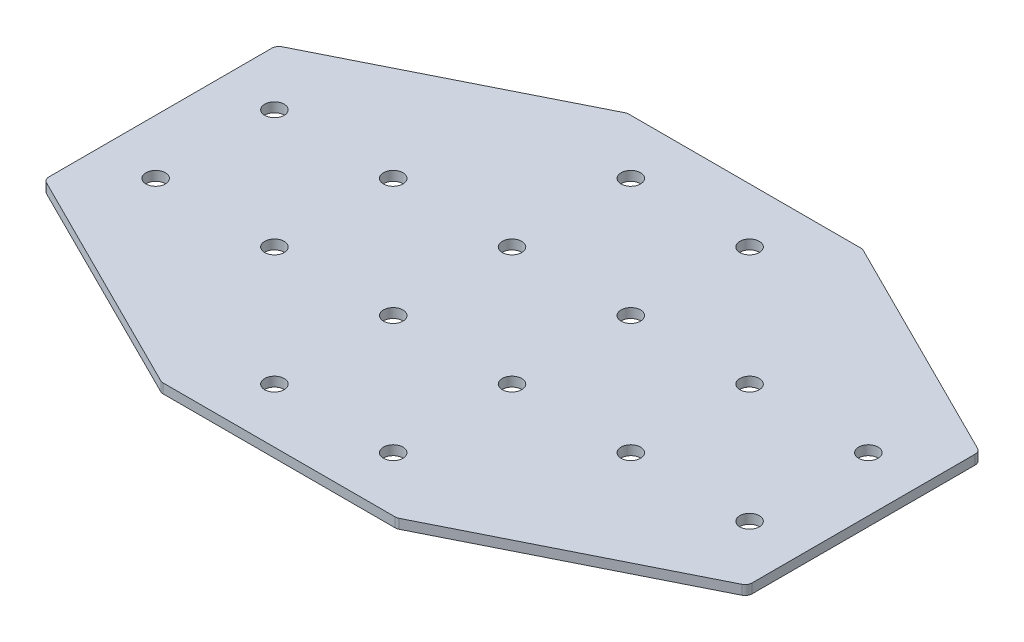
ISO-10303-21;
HEADER;
FILE_DESCRIPTION(('STEP AP214'),'2;1');
FILE_NAME('part.step','',(''),(''),'','','');
FILE_SCHEMA(('AUTOMOTIVE_DESIGN { 1 0 10303 214 1 1 1 1 }'));
ENDSEC;
DATA;
#1=APPLICATION_CONTEXT('core data for automotive mechanical design processes');
#2=APPLICATION_PROTOCOL_DEFINITION('international standard','automotive_design',2000,#1);
#3=PRODUCT_CONTEXT('',#1,'mechanical');
#4=PRODUCT('Part','Part','',(#3));
#5=PRODUCT_RELATED_PRODUCT_CATEGORY('part','',(#4));
#6=PRODUCT_DEFINITION_FORMATION('','',#4);
#7=PRODUCT_DEFINITION_CONTEXT('part definition',#1,'design');
#8=PRODUCT_DEFINITION('design','',#6,#7);
#9=PRODUCT_DEFINITION_SHAPE('','',#8);
#10=(LENGTH_UNIT() NAMED_UNIT(*) SI_UNIT(.MILLI.,.METRE.));
#11=(NAMED_UNIT(*) PLANE_ANGLE_UNIT() SI_UNIT($,.RADIAN.));
#12=(NAMED_UNIT(*) SI_UNIT($,.STERADIAN.) SOLID_ANGLE_UNIT());
#13=UNCERTAINTY_MEASURE_WITH_UNIT(LENGTH_MEASURE(1.E-05),#10,'distance_accuracy_value','');
#14=(GEOMETRIC_REPRESENTATION_CONTEXT(3) GLOBAL_UNCERTAINTY_ASSIGNED_CONTEXT((#13)) GLOBAL_UNIT_ASSIGNED_CONTEXT((#10,
#11,#12)) REPRESENTATION_CONTEXT('',''));
#15=CARTESIAN_POINT('',(0.,0.,0.));
#16=DIRECTION('',(0.,0.,1.));
#17=DIRECTION('',(1.,0.,0.));
#18=AXIS2_PLACEMENT_3D('',#15,#16,#17);
#19=CARTESIAN_POINT('',(-1.37420990733972,0.924626277206244,-1.54994107469975));
#20=DIRECTION('',(0.,-1.,0.));
#21=DIRECTION('',(0.,0.,-1.));
#22=AXIS2_PLACEMENT_3D('',#19,#20,#21);
#23=PLANE('',#22);
#24=CARTESIAN_POINT('',(-26.3742099073397,0.924626277206244,23.4500589253003));
#25=DIRECTION('',(0.,-1.,0.));
#26=DIRECTION('',(0.,0.,1.));
#27=AXIS2_PLACEMENT_3D('',#24,#25,#26);
#28=CIRCLE('',#27,4.1);
#29=CARTESIAN_POINT('',(-26.3742099073397,0.924626277206244,27.5500589253003));
#30=VERTEX_POINT('',#29);
#31=EDGE_CURVE('E140',#30,#30,#28,.T.);
#32=ORIENTED_EDGE('',*,*,#31,.F.);
#33=EDGE_LOOP('',(#32));
#34=FACE_BOUND('',#33,.T.);
#35=CARTESIAN_POINT('',(-26.3742099073397,0.924626277206244,73.4500589253003));
#36=DIRECTION('',(0.,-1.,0.));
#37=DIRECTION('',(0.,0.,1.));
#38=AXIS2_PLACEMENT_3D('',#35,#36,#37);
#39=CIRCLE('',#38,4.10000000000001);
#40=CARTESIAN_POINT('',(-26.3742099073397,0.924626277206244,77.5500589253003));
#41=VERTEX_POINT('',#40);
#42=EDGE_CURVE('E243',#41,#41,#39,.T.);
#43=ORIENTED_EDGE('',*,*,#42,.F.);
#44=EDGE_LOOP('',(#43));
#45=FACE_BOUND('',#44,.T.);
#46=CARTESIAN_POINT('',(-76.3742099073397,0.924626277206244,23.4500589253003));
#47=DIRECTION('',(0.,-1.,0.));
#48=DIRECTION('',(0.,0.,1.));
#49=AXIS2_PLACEMENT_3D('',#46,#47,#48);
#50=CIRCLE('',#49,4.09999999999999);
#51=CARTESIAN_POINT('',(-76.3742099073397,0.924626277206244,27.5500589253003));
#52=VERTEX_POINT('',#51);
#53=EDGE_CURVE('E237',#52,#52,#50,.T.);
#54=ORIENTED_EDGE('',*,*,#53,.F.);
#55=EDGE_LOOP('',(#54));
#56=FACE_BOUND('',#55,.T.);
#57=CARTESIAN_POINT('',(-126.37420990734,0.924626277206244,23.4500589253003));
#58=DIRECTION('',(0.,-1.,0.));
#59=DIRECTION('',(0.,0.,1.));
#60=AXIS2_PLACEMENT_3D('',#57,#58,#59);
#61=CIRCLE('',#60,4.1);
#62=CARTESIAN_POINT('',(-126.37420990734,0.924626277206244,27.5500589253003));
#63=VERTEX_POINT('',#62);
#64=EDGE_CURVE('E231',#63,#63,#61,.T.);
#65=ORIENTED_EDGE('',*,*,#64,.F.);
#66=EDGE_LOOP('',(#65));
#67=FACE_BOUND('',#66,.T.);
#68=CARTESIAN_POINT('',(23.6257900926603,0.924626277206244,23.4500589253002));
#69=DIRECTION('',(0.,1.,0.));
#70=DIRECTION('',(0.,0.,1.));
#71=AXIS2_PLACEMENT_3D('',#68,#69,#70);
#72=CIRCLE('',#71,4.1);
#73=CARTESIAN_POINT('',(23.6257900926603,0.924626277206244,27.5500589253002));
#74=VERTEX_POINT('',#73);
#75=EDGE_CURVE('E298',#74,#74,#72,.T.);
#76=ORIENTED_EDGE('',*,*,#75,.T.);
#77=EDGE_LOOP('',(#76));
#78=FACE_BOUND('',#77,.T.);
#79=CARTESIAN_POINT('',(23.6257900926603,0.924626277206244,73.4500589253003));
#80=DIRECTION('',(0.,1.,0.));
#81=DIRECTION('',(0.,0.,1.));
#82=AXIS2_PLACEMENT_3D('',#79,#80,#81);
#83=CIRCLE('',#82,4.10000000000001);
#84=CARTESIAN_POINT('',(23.6257900926603,0.924626277206244,77.5500589253003));
#85=VERTEX_POINT('',#84);
#86=EDGE_CURVE('E292',#85,#85,#83,.T.);
#87=ORIENTED_EDGE('',*,*,#86,.T.);
#88=EDGE_LOOP('',(#87));
#89=FACE_BOUND('',#88,.T.);
#90=CARTESIAN_POINT('',(73.6257900926603,0.924626277206244,23.4500589253003));
#91=DIRECTION('',(0.,1.,0.));
#92=DIRECTION('',(0.,0.,1.));
#93=AXIS2_PLACEMENT_3D('',#90,#91,#92);
#94=CIRCLE('',#93,4.09999999999999);
#95=CARTESIAN_POINT('',(73.6257900926603,0.924626277206244,27.5500589253002));
#96=VERTEX_POINT('',#95);
#97=EDGE_CURVE('E286',#96,#96,#94,.T.);
#98=ORIENTED_EDGE('',*,*,#97,.T.);
#99=EDGE_LOOP('',(#98));
#100=FACE_BOUND('',#99,.T.);
#101=CARTESIAN_POINT('',(123.62579009266,0.924626277206244,23.4500589253003));
#102=DIRECTION('',(0.,1.,0.));
#103=DIRECTION('',(0.,0.,1.));
#104=AXIS2_PLACEMENT_3D('',#101,#102,#103);
#105=CIRCLE('',#104,4.1);
#106=CARTESIAN_POINT('',(123.62579009266,0.924626277206244,27.5500589253003));
#107=VERTEX_POINT('',#106);
#108=EDGE_CURVE('E280',#107,#107,#105,.T.);
#109=ORIENTED_EDGE('',*,*,#108,.T.);
#110=EDGE_LOOP('',(#109));
#111=FACE_BOUND('',#110,.T.);
#112=DIRECTION('',(0.,0.,-1.));
#113=VECTOR('',#112,1.);
#114=CARTESIAN_POINT('',(-149.37420990734,0.924626277206244,47.2139909478006));
#115=LINE('',#114,#113);
#116=CARTESIAN_POINT('',(-149.37420990734,0.924626277206244,45.3598889815509));
#117=VERTEX_POINT('',#116);
#118=CARTESIAN_POINT('',(-149.37420990734,0.924626277206244,-48.4597711309504));
#119=VERTEX_POINT('',#118);
#120=EDGE_CURVE('E253',#117,#119,#115,.T.);
#121=ORIENTED_EDGE('',*,*,#120,.T.);
#122=CARTESIAN_POINT('',(-146.37420990734,0.924626277206244,-48.4597711309504));
#123=DIRECTION('',(0.,-1.,0.));
#124=DIRECTION('',(0.,0.,1.));
#125=AXIS2_PLACEMENT_3D('',#122,#123,#124);
#126=CIRCLE('',#125,3.);
#127=CARTESIAN_POINT('',(-147.715850693839,0.924626277206244,-51.1430527039501));
#128=VERTEX_POINT('',#127);
#129=EDGE_CURVE('E148',#119,#128,#126,.T.);
#130=ORIENTED_EDGE('',*,*,#129,.T.);
#131=DIRECTION('',(-0.894427190999916,0.,0.447213595499958));
#132=VECTOR('',#131,1.);
#133=CARTESIAN_POINT('',(-50.9020739523403,0.924626277206244,-99.5499410746997));
#134=LINE('',#133,#132);
#135=CARTESIAN_POINT('',(-51.5355108063408,0.924626277206244,-99.2332226476994));
#136=VERTEX_POINT('',#135);
#137=EDGE_CURVE('E158',#136,#128,#134,.T.);
#138=ORIENTED_EDGE('',*,*,#137,.F.);
#139=CARTESIAN_POINT('',(-50.1938700198409,0.924626277206244,-96.5499410746997));
#140=DIRECTION('',(0.,-1.,0.));
#141=DIRECTION('',(0.,0.,1.));
#142=AXIS2_PLACEMENT_3D('',#139,#140,#141);
#143=CIRCLE('',#142,3.);
#144=CARTESIAN_POINT('',(-50.1938700198409,0.924626277206244,-99.5499410746997));
#145=VERTEX_POINT('',#144);
#146=EDGE_CURVE('E168',#136,#145,#143,.T.);
#147=ORIENTED_EDGE('',*,*,#146,.T.);
#148=DIRECTION('',(1.,0.,0.));
#149=VECTOR('',#148,1.);
#150=CARTESIAN_POINT('',(-49.3742099073398,0.924626277206244,-99.5499410746997));
#151=LINE('',#150,#149);
#152=CARTESIAN_POINT('',(47.4454502051615,0.924626277206244,-99.5499410746997));
#153=VERTEX_POINT('',#152);
#154=EDGE_CURVE('E198',#145,#153,#151,.T.);
#155=ORIENTED_EDGE('',*,*,#154,.T.);
#156=CARTESIAN_POINT('',(47.4454502051615,0.924626277206244,-96.5499410746997));
#157=DIRECTION('',(0.,1.,0.));
#158=DIRECTION('',(0.,0.,1.));
#159=AXIS2_PLACEMENT_3D('',#156,#157,#158);
#160=CIRCLE('',#159,3.);
#161=CARTESIAN_POINT('',(48.7870909916614,0.924626277206244,-99.2332226476994));
#162=VERTEX_POINT('',#161);
#163=EDGE_CURVE('E220',#162,#153,#160,.T.);
#164=ORIENTED_EDGE('',*,*,#163,.F.);
#165=DIRECTION('',(0.894427190999916,0.,0.447213595499958));
#166=VECTOR('',#165,1.);
#167=CARTESIAN_POINT('',(48.1536541376608,0.924626277206244,-99.5499410746997));
#168=LINE('',#167,#166);
#169=CARTESIAN_POINT('',(144.96743087916,0.924626277206244,-51.1430527039501));
#170=VERTEX_POINT('',#169);
#171=EDGE_CURVE('E201',#162,#170,#168,.T.);
#172=ORIENTED_EDGE('',*,*,#171,.T.);
#173=CARTESIAN_POINT('',(143.62579009266,0.924626277206244,-48.4597711309503));
#174=DIRECTION('',(0.,1.,0.));
#175=DIRECTION('',(0.,0.,1.));
#176=AXIS2_PLACEMENT_3D('',#173,#174,#175);
#177=CIRCLE('',#176,3.);
#178=CARTESIAN_POINT('',(146.62579009266,0.924626277206244,-48.4597711309503));
#179=VERTEX_POINT('',#178);
#180=EDGE_CURVE('E217',#179,#170,#177,.T.);
#181=ORIENTED_EDGE('',*,*,#180,.F.);
#182=DIRECTION('',(0.,0.,-1.));
#183=VECTOR('',#182,1.);
#184=CARTESIAN_POINT('',(146.62579009266,0.924626277206244,47.2139909478005));
#185=LINE('',#184,#183);
#186=CARTESIAN_POINT('',(146.62579009266,0.924626277206244,45.3598889815508));
#187=VERTEX_POINT('',#186);
#188=EDGE_CURVE('E304',#187,#179,#185,.T.);
#189=ORIENTED_EDGE('',*,*,#188,.F.);
#190=CARTESIAN_POINT('',(143.62579009266,0.924626277206244,45.3598889815508));
#191=DIRECTION('',(0.,-1.,0.));
#192=DIRECTION('',(0.,0.,-1.));
#193=AXIS2_PLACEMENT_3D('',#190,#191,#192);
#194=CIRCLE('',#193,3.);
#195=CARTESIAN_POINT('',(144.96743087916,0.924626277206244,48.0431705545506));
#196=VERTEX_POINT('',#195);
#197=EDGE_CURVE('E31',#187,#196,#194,.T.);
#198=ORIENTED_EDGE('',*,*,#197,.T.);
#199=DIRECTION('',(0.894427190999916,0.,-0.447213595499958));
#200=VECTOR('',#199,1.);
#201=CARTESIAN_POINT('',(48.1536541376608,0.924626277206244,96.4500589253002));
#202=LINE('',#201,#200);
#203=CARTESIAN_POINT('',(48.7870909916614,0.924626277206244,96.1333404982999));
#204=VERTEX_POINT('',#203);
#205=EDGE_CURVE('E309',#204,#196,#202,.T.);
#206=ORIENTED_EDGE('',*,*,#205,.F.);
#207=CARTESIAN_POINT('',(47.4454502051615,0.924626277206244,93.4500589253002));
#208=DIRECTION('',(0.,-1.,0.));
#209=DIRECTION('',(0.,0.,-1.));
#210=AXIS2_PLACEMENT_3D('',#207,#208,#209);
#211=CIRCLE('',#210,3.);
#212=CARTESIAN_POINT('',(47.4454502051615,0.924626277206244,96.4500589253002));
#213=VERTEX_POINT('',#212);
#214=EDGE_CURVE('E324',#204,#213,#211,.T.);
#215=ORIENTED_EDGE('',*,*,#214,.T.);
#216=DIRECTION('',(1.,0.,0.));
#217=VECTOR('',#216,1.);
#218=CARTESIAN_POINT('',(-49.3742099073398,0.924626277206244,96.4500589253002));
#219=LINE('',#218,#217);
#220=CARTESIAN_POINT('',(-50.1938700198409,0.924626277206244,96.4500589253002));
#221=VERTEX_POINT('',#220);
#222=EDGE_CURVE('E306',#221,#213,#219,.T.);
#223=ORIENTED_EDGE('',*,*,#222,.F.);
#224=CARTESIAN_POINT('',(-50.1938700198409,0.924626277206244,93.4500589253002));
#225=DIRECTION('',(0.,1.,0.));
#226=DIRECTION('',(0.,0.,-1.));
#227=AXIS2_PLACEMENT_3D('',#224,#225,#226);
#228=CIRCLE('',#227,3.);
#229=CARTESIAN_POINT('',(-51.5355108063408,0.924626277206244,96.1333404983));
#230=VERTEX_POINT('',#229);
#231=EDGE_CURVE('E270',#230,#221,#228,.T.);
#232=ORIENTED_EDGE('',*,*,#231,.F.);
#233=DIRECTION('',(-0.894427190999916,0.,-0.447213595499958));
#234=VECTOR('',#233,1.);
#235=CARTESIAN_POINT('',(-50.9020739523403,0.924626277206244,96.4500589253002));
#236=LINE('',#235,#234);
#237=CARTESIAN_POINT('',(-147.715850693839,0.924626277206244,48.0431705545506));
#238=VERTEX_POINT('',#237);
#239=EDGE_CURVE('E255',#230,#238,#236,.T.);
#240=ORIENTED_EDGE('',*,*,#239,.T.);
#241=CARTESIAN_POINT('',(-146.37420990734,0.924626277206244,45.3598889815509));
#242=DIRECTION('',(0.,1.,0.));
#243=DIRECTION('',(0.,0.,-1.));
#244=AXIS2_PLACEMENT_3D('',#241,#242,#243);
#245=CIRCLE('',#244,3.);
#246=EDGE_CURVE('E267',#117,#238,#245,.T.);
#247=ORIENTED_EDGE('',*,*,#246,.F.);
#248=EDGE_LOOP('',(#121,#130,#138,#147,#155,#164,#172,#181,#189,#198,#206,#215,#223,#232,#240,#247));
#249=FACE_BOUND('',#248,.T.);
#250=CARTESIAN_POINT('',(-26.3742099073397,0.924626277206244,-26.5499410746997));
#251=DIRECTION('',(0.,1.,0.));
#252=DIRECTION('',(0.,0.,-1.));
#253=AXIS2_PLACEMENT_3D('',#250,#251,#252);
#254=CIRCLE('',#253,4.1);
#255=CARTESIAN_POINT('',(-26.3742099073397,0.924626277206244,-30.6499410746997));
#256=VERTEX_POINT('',#255);
#257=EDGE_CURVE('E352',#256,#256,#254,.T.);
#258=ORIENTED_EDGE('',*,*,#257,.T.);
#259=EDGE_LOOP('',(#258));
#260=FACE_BOUND('',#259,.T.);
#261=CARTESIAN_POINT('',(-26.3742099073397,0.924626277206244,-76.5499410746998));
#262=DIRECTION('',(0.,1.,0.));
#263=DIRECTION('',(0.,0.,-1.));
#264=AXIS2_PLACEMENT_3D('',#261,#262,#263);
#265=CIRCLE('',#264,4.10000000000001);
#266=CARTESIAN_POINT('',(-26.3742099073397,0.924626277206244,-80.6499410746998));
#267=VERTEX_POINT('',#266);
#268=EDGE_CURVE('E356',#267,#267,#265,.T.);
#269=ORIENTED_EDGE('',*,*,#268,.T.);
#270=EDGE_LOOP('',(#269));
#271=FACE_BOUND('',#270,.T.);
#272=CARTESIAN_POINT('',(-76.3742099073397,0.924626277206244,-26.5499410746998));
#273=DIRECTION('',(0.,1.,0.));
#274=DIRECTION('',(0.,0.,-1.));
#275=AXIS2_PLACEMENT_3D('',#272,#273,#274);
#276=CIRCLE('',#275,4.09999999999999);
#277=CARTESIAN_POINT('',(-76.3742099073397,0.924626277206244,-30.6499410746998));
#278=VERTEX_POINT('',#277);
#279=EDGE_CURVE('E360',#278,#278,#276,.T.);
#280=ORIENTED_EDGE('',*,*,#279,.T.);
#281=EDGE_LOOP('',(#280));
#282=FACE_BOUND('',#281,.T.);
#283=CARTESIAN_POINT('',(-126.37420990734,0.924626277206244,-26.5499410746998));
#284=DIRECTION('',(0.,1.,0.));
#285=DIRECTION('',(0.,0.,-1.));
#286=AXIS2_PLACEMENT_3D('',#283,#284,#285);
#287=CIRCLE('',#286,4.1);
#288=CARTESIAN_POINT('',(-126.37420990734,0.924626277206244,-30.6499410746998));
#289=VERTEX_POINT('',#288);
#290=EDGE_CURVE('E364',#289,#289,#287,.T.);
#291=ORIENTED_EDGE('',*,*,#290,.T.);
#292=EDGE_LOOP('',(#291));
#293=FACE_BOUND('',#292,.T.);
#294=CARTESIAN_POINT('',(23.6257900926603,0.924626277206244,-26.5499410746997));
#295=DIRECTION('',(0.,-1.,0.));
#296=DIRECTION('',(0.,0.,-1.));
#297=AXIS2_PLACEMENT_3D('',#294,#295,#296);
#298=CIRCLE('',#297,4.1);
#299=CARTESIAN_POINT('',(23.6257900926603,0.924626277206244,-30.6499410746997));
#300=VERTEX_POINT('',#299);
#301=EDGE_CURVE('E192',#300,#300,#298,.T.);
#302=ORIENTED_EDGE('',*,*,#301,.F.);
#303=EDGE_LOOP('',(#302));
#304=FACE_BOUND('',#303,.T.);
#305=CARTESIAN_POINT('',(23.6257900926603,0.924626277206244,-76.5499410746998));
#306=DIRECTION('',(0.,-1.,0.));
#307=DIRECTION('',(0.,0.,-1.));
#308=AXIS2_PLACEMENT_3D('',#305,#306,#307);
#309=CIRCLE('',#308,4.10000000000001);
#310=CARTESIAN_POINT('',(23.6257900926603,0.924626277206244,-80.6499410746998));
#311=VERTEX_POINT('',#310);
#312=EDGE_CURVE('E186',#311,#311,#309,.T.);
#313=ORIENTED_EDGE('',*,*,#312,.F.);
#314=EDGE_LOOP('',(#313));
#315=FACE_BOUND('',#314,.T.);
#316=CARTESIAN_POINT('',(73.6257900926603,0.924626277206244,-26.5499410746997));
#317=DIRECTION('',(0.,-1.,0.));
#318=DIRECTION('',(0.,0.,-1.));
#319=AXIS2_PLACEMENT_3D('',#316,#317,#318);
#320=CIRCLE('',#319,4.09999999999999);
#321=CARTESIAN_POINT('',(73.6257900926603,0.924626277206244,-30.6499410746997));
#322=VERTEX_POINT('',#321);
#323=EDGE_CURVE('E180',#322,#322,#320,.T.);
#324=ORIENTED_EDGE('',*,*,#323,.F.);
#325=EDGE_LOOP('',(#324));
#326=FACE_BOUND('',#325,.T.);
#327=CARTESIAN_POINT('',(123.62579009266,0.924626277206244,-26.5499410746998));
#328=DIRECTION('',(0.,-1.,0.));
#329=DIRECTION('',(0.,0.,-1.));
#330=AXIS2_PLACEMENT_3D('',#327,#328,#329);
#331=CIRCLE('',#330,4.1);
#332=CARTESIAN_POINT('',(123.62579009266,0.924626277206244,-30.6499410746998));
#333=VERTEX_POINT('',#332);
#334=EDGE_CURVE('E174',#333,#333,#331,.T.);
#335=ORIENTED_EDGE('',*,*,#334,.F.);
#336=EDGE_LOOP('',(#335));
#337=FACE_BOUND('',#336,.T.);
#338=ADVANCED_FACE('F16',(#34,#45,#56,#67,#78,#89,#100,#111,#249,#260,#271,#282,#293,#304,#315,
#326,#337),#23,.T.);
#339=CARTESIAN_POINT('',(146.62579009266,0.924626277206244,47.2139909478005));
#340=DIRECTION('',(1.,0.,0.));
#341=DIRECTION('',(0.,0.,-1.));
#342=AXIS2_PLACEMENT_3D('',#339,#340,#341);
#343=PLANE('',#342);
#344=ORIENTED_EDGE('',*,*,#188,.T.);
#345=DIRECTION('',(0.,1.,0.));
#346=VECTOR('',#345,1.);
#347=CARTESIAN_POINT('',(146.62579009266,0.924626277206244,-48.4597711309503));
#348=LINE('',#347,#346);
#349=CARTESIAN_POINT('',(146.62579009266,4.92462627720624,-48.4597711309503));
#350=VERTEX_POINT('',#349);
#351=EDGE_CURVE('E227',#350,#179,#348,.F.);
#352=ORIENTED_EDGE('',*,*,#351,.F.);
#353=DIRECTION('',(0.,0.,-1.));
#354=VECTOR('',#353,1.);
#355=CARTESIAN_POINT('',(146.62579009266,4.92462627720624,47.2139909478005));
#356=LINE('',#355,#354);
#357=CARTESIAN_POINT('',(146.62579009266,4.92462627720624,45.3598889815508));
#358=VERTEX_POINT('',#357);
#359=EDGE_CURVE('E301',#358,#350,#356,.T.);
#360=ORIENTED_EDGE('',*,*,#359,.F.);
#361=DIRECTION('',(0.,1.,0.));
#362=VECTOR('',#361,1.);
#363=CARTESIAN_POINT('',(146.62579009266,0.924626277206244,45.3598889815508));
#364=LINE('',#363,#362);
#365=EDGE_CURVE('E10',#358,#187,#364,.F.);
#366=ORIENTED_EDGE('',*,*,#365,.T.);
#367=EDGE_LOOP('',(#344,#352,#360,#366));
#368=FACE_BOUND('',#367,.T.);
#369=ADVANCED_FACE('F346',(#368),#343,.T.);
#370=CARTESIAN_POINT('',(-1.37420990733972,4.92462627720624,-1.54994107469975));
#371=DIRECTION('',(0.,-1.,0.));
#372=DIRECTION('',(0.,0.,-1.));
#373=AXIS2_PLACEMENT_3D('',#370,#371,#372);
#374=PLANE('',#373);
#375=CARTESIAN_POINT('',(-26.3742099073397,4.92462627720624,23.4500589253003));
#376=DIRECTION('',(0.,-1.,0.));
#377=DIRECTION('',(0.,0.,1.));
#378=AXIS2_PLACEMENT_3D('',#375,#376,#377);
#379=CIRCLE('',#378,4.1);
#380=CARTESIAN_POINT('',(-26.3742099073397,4.92462627720624,27.5500589253003));
#381=VERTEX_POINT('',#380);
#382=EDGE_CURVE('E246',#381,#381,#379,.T.);
#383=ORIENTED_EDGE('',*,*,#382,.T.);
#384=EDGE_LOOP('',(#383));
#385=FACE_BOUND('',#384,.T.);
#386=CARTESIAN_POINT('',(-26.3742099073397,4.92462627720624,73.4500589253003));
#387=DIRECTION('',(0.,-1.,0.));
#388=DIRECTION('',(0.,0.,1.));
#389=AXIS2_PLACEMENT_3D('',#386,#387,#388);
#390=CIRCLE('',#389,4.10000000000001);
#391=CARTESIAN_POINT('',(-26.3742099073397,4.92462627720624,77.5500589253003));
#392=VERTEX_POINT('',#391);
#393=EDGE_CURVE('E240',#392,#392,#390,.T.);
#394=ORIENTED_EDGE('',*,*,#393,.T.);
#395=EDGE_LOOP('',(#394));
#396=FACE_BOUND('',#395,.T.);
#397=CARTESIAN_POINT('',(-76.3742099073397,4.92462627720624,23.4500589253003));
#398=DIRECTION('',(0.,-1.,0.));
#399=DIRECTION('',(0.,0.,1.));
#400=AXIS2_PLACEMENT_3D('',#397,#398,#399);
#401=CIRCLE('',#400,4.09999999999999);
#402=CARTESIAN_POINT('',(-76.3742099073397,4.92462627720624,27.5500589253003));
#403=VERTEX_POINT('',#402);
#404=EDGE_CURVE('E234',#403,#403,#401,.T.);
#405=ORIENTED_EDGE('',*,*,#404,.T.);
#406=EDGE_LOOP('',(#405));
#407=FACE_BOUND('',#406,.T.);
#408=CARTESIAN_POINT('',(-126.37420990734,4.92462627720624,23.4500589253003));
#409=DIRECTION('',(0.,-1.,0.));
#410=DIRECTION('',(0.,0.,1.));
#411=AXIS2_PLACEMENT_3D('',#408,#409,#410);
#412=CIRCLE('',#411,4.1);
#413=CARTESIAN_POINT('',(-126.37420990734,4.92462627720624,27.5500589253003));
#414=VERTEX_POINT('',#413);
#415=EDGE_CURVE('E230',#414,#414,#412,.T.);
#416=ORIENTED_EDGE('',*,*,#415,.T.);
#417=EDGE_LOOP('',(#416));
#418=FACE_BOUND('',#417,.T.);
#419=CARTESIAN_POINT('',(23.6257900926603,4.92462627720624,23.4500589253002));
#420=DIRECTION('',(0.,1.,0.));
#421=DIRECTION('',(0.,0.,1.));
#422=AXIS2_PLACEMENT_3D('',#419,#420,#421);
#423=CIRCLE('',#422,4.1);
#424=CARTESIAN_POINT('',(23.6257900926603,4.92462627720624,27.5500589253002));
#425=VERTEX_POINT('',#424);
#426=EDGE_CURVE('E295',#425,#425,#423,.T.);
#427=ORIENTED_EDGE('',*,*,#426,.F.);
#428=EDGE_LOOP('',(#427));
#429=FACE_BOUND('',#428,.T.);
#430=CARTESIAN_POINT('',(23.6257900926603,4.92462627720624,73.4500589253003));
#431=DIRECTION('',(0.,1.,0.));
#432=DIRECTION('',(0.,0.,1.));
#433=AXIS2_PLACEMENT_3D('',#430,#431,#432);
#434=CIRCLE('',#433,4.10000000000001);
#435=CARTESIAN_POINT('',(23.6257900926603,4.92462627720624,77.5500589253003));
#436=VERTEX_POINT('',#435);
#437=EDGE_CURVE('E289',#436,#436,#434,.T.);
#438=ORIENTED_EDGE('',*,*,#437,.F.);
#439=EDGE_LOOP('',(#438));
#440=FACE_BOUND('',#439,.T.);
#441=CARTESIAN_POINT('',(73.6257900926603,4.92462627720624,23.4500589253003));
#442=DIRECTION('',(0.,1.,0.));
#443=DIRECTION('',(0.,0.,1.));
#444=AXIS2_PLACEMENT_3D('',#441,#442,#443);
#445=CIRCLE('',#444,4.09999999999999);
#446=CARTESIAN_POINT('',(73.6257900926603,4.92462627720624,27.5500589253002));
#447=VERTEX_POINT('',#446);
#448=EDGE_CURVE('E283',#447,#447,#445,.T.);
#449=ORIENTED_EDGE('',*,*,#448,.F.);
#450=EDGE_LOOP('',(#449));
#451=FACE_BOUND('',#450,.T.);
#452=CARTESIAN_POINT('',(123.62579009266,4.92462627720624,23.4500589253003));
#453=DIRECTION('',(0.,1.,0.));
#454=DIRECTION('',(0.,0.,1.));
#455=AXIS2_PLACEMENT_3D('',#452,#453,#454);
#456=CIRCLE('',#455,4.1);
#457=CARTESIAN_POINT('',(123.62579009266,4.92462627720624,27.5500589253003));
#458=VERTEX_POINT('',#457);
#459=EDGE_CURVE('E279',#458,#458,#456,.T.);
#460=ORIENTED_EDGE('',*,*,#459,.F.);
#461=EDGE_LOOP('',(#460));
#462=FACE_BOUND('',#461,.T.);
#463=ORIENTED_EDGE('',*,*,#359,.T.);
#464=CARTESIAN_POINT('',(143.62579009266,4.92462627720624,-48.4597711309503));
#465=DIRECTION('',(0.,1.,0.));
#466=DIRECTION('',(0.,0.,1.));
#467=AXIS2_PLACEMENT_3D('',#464,#465,#466);
#468=CIRCLE('',#467,3.);
#469=CARTESIAN_POINT('',(144.96743087916,4.92462627720624,-51.1430527039501));
#470=VERTEX_POINT('',#469);
#471=EDGE_CURVE('E205',#470,#350,#468,.F.);
#472=ORIENTED_EDGE('',*,*,#471,.F.);
#473=DIRECTION('',(0.894427190999916,0.,0.447213595499958));
#474=VECTOR('',#473,1.);
#475=CARTESIAN_POINT('',(48.1536541376608,4.92462627720624,-99.5499410746997));
#476=LINE('',#475,#474);
#477=CARTESIAN_POINT('',(48.7870909916614,4.92462627720624,-99.2332226476994));
#478=VERTEX_POINT('',#477);
#479=EDGE_CURVE('E202',#478,#470,#476,.T.);
#480=ORIENTED_EDGE('',*,*,#479,.F.);
#481=CARTESIAN_POINT('',(47.4454502051615,4.92462627720624,-96.5499410746997));
#482=DIRECTION('',(0.,1.,0.));
#483=DIRECTION('',(0.,0.,1.));
#484=AXIS2_PLACEMENT_3D('',#481,#482,#483);
#485=CIRCLE('',#484,3.);
#486=CARTESIAN_POINT('',(47.4454502051615,4.92462627720624,-99.5499410746997));
#487=VERTEX_POINT('',#486);
#488=EDGE_CURVE('E212',#487,#478,#485,.F.);
#489=ORIENTED_EDGE('',*,*,#488,.F.);
#490=DIRECTION('',(1.,0.,0.));
#491=VECTOR('',#490,1.);
#492=CARTESIAN_POINT('',(-49.3742099073398,4.92462627720624,-99.5499410746997));
#493=LINE('',#492,#491);
#494=CARTESIAN_POINT('',(-50.1938700198409,4.92462627720624,-99.5499410746997));
#495=VERTEX_POINT('',#494);
#496=EDGE_CURVE('E195',#495,#487,#493,.T.);
#497=ORIENTED_EDGE('',*,*,#496,.F.);
#498=CARTESIAN_POINT('',(-50.1938700198409,4.92462627720624,-96.5499410746997));
#499=DIRECTION('',(0.,-1.,0.));
#500=DIRECTION('',(0.,0.,1.));
#501=AXIS2_PLACEMENT_3D('',#498,#499,#500);
#502=CIRCLE('',#501,3.);
#503=CARTESIAN_POINT('',(-51.5355108063408,4.92462627720624,-99.2332226476994));
#504=VERTEX_POINT('',#503);
#505=EDGE_CURVE('E157',#495,#504,#502,.F.);
#506=ORIENTED_EDGE('',*,*,#505,.T.);
#507=DIRECTION('',(-0.894427190999916,0.,0.447213595499958));
#508=VECTOR('',#507,1.);
#509=CARTESIAN_POINT('',(-50.9020739523403,4.92462627720624,-99.5499410746997));
#510=LINE('',#509,#508);
#511=CARTESIAN_POINT('',(-147.715850693839,4.92462627720624,-51.1430527039501));
#512=VERTEX_POINT('',#511);
#513=EDGE_CURVE('E156',#504,#512,#510,.T.);
#514=ORIENTED_EDGE('',*,*,#513,.T.);
#515=CARTESIAN_POINT('',(-146.37420990734,4.92462627720624,-48.4597711309504));
#516=DIRECTION('',(0.,-1.,0.));
#517=DIRECTION('',(0.,0.,1.));
#518=AXIS2_PLACEMENT_3D('',#515,#516,#517);
#519=CIRCLE('',#518,3.);
#520=CARTESIAN_POINT('',(-149.37420990734,4.92462627720624,-48.4597711309504));
#521=VERTEX_POINT('',#520);
#522=EDGE_CURVE('E145',#512,#521,#519,.F.);
#523=ORIENTED_EDGE('',*,*,#522,.T.);
#524=DIRECTION('',(0.,0.,-1.));
#525=VECTOR('',#524,1.);
#526=CARTESIAN_POINT('',(-149.37420990734,4.92462627720624,47.2139909478006));
#527=LINE('',#526,#525);
#528=CARTESIAN_POINT('',(-149.37420990734,4.92462627720624,45.3598889815509));
#529=VERTEX_POINT('',#528);
#530=EDGE_CURVE('E130',#529,#521,#527,.T.);
#531=ORIENTED_EDGE('',*,*,#530,.F.);
#532=CARTESIAN_POINT('',(-146.37420990734,4.92462627720624,45.3598889815509));
#533=DIRECTION('',(0.,1.,0.));
#534=DIRECTION('',(0.,0.,-1.));
#535=AXIS2_PLACEMENT_3D('',#532,#533,#534);
#536=CIRCLE('',#535,3.);
#537=CARTESIAN_POINT('',(-147.715850693839,4.92462627720624,48.0431705545506));
#538=VERTEX_POINT('',#537);
#539=EDGE_CURVE('E257',#538,#529,#536,.F.);
#540=ORIENTED_EDGE('',*,*,#539,.F.);
#541=DIRECTION('',(-0.894427190999916,0.,-0.447213595499958));
#542=VECTOR('',#541,1.);
#543=CARTESIAN_POINT('',(-50.9020739523403,4.92462627720624,96.4500589253002));
#544=LINE('',#543,#542);
#545=CARTESIAN_POINT('',(-51.5355108063408,4.92462627720624,96.1333404983));
#546=VERTEX_POINT('',#545);
#547=EDGE_CURVE('E139',#546,#538,#544,.T.);
#548=ORIENTED_EDGE('',*,*,#547,.F.);
#549=CARTESIAN_POINT('',(-50.1938700198409,4.92462627720624,93.4500589253002));
#550=DIRECTION('',(0.,1.,0.));
#551=DIRECTION('',(0.,0.,-1.));
#552=AXIS2_PLACEMENT_3D('',#549,#550,#551);
#553=CIRCLE('',#552,3.);
#554=CARTESIAN_POINT('',(-50.1938700198409,4.92462627720624,96.4500589253002));
#555=VERTEX_POINT('',#554);
#556=EDGE_CURVE('E262',#555,#546,#553,.F.);
#557=ORIENTED_EDGE('',*,*,#556,.F.);
#558=DIRECTION('',(1.,0.,0.));
#559=VECTOR('',#558,1.);
#560=CARTESIAN_POINT('',(-49.3742099073398,4.92462627720624,96.4500589253002));
#561=LINE('',#560,#559);
#562=CARTESIAN_POINT('',(47.4454502051615,4.92462627720624,96.4500589253002));
#563=VERTEX_POINT('',#562);
#564=EDGE_CURVE('E313',#555,#563,#561,.T.);
#565=ORIENTED_EDGE('',*,*,#564,.T.);
#566=CARTESIAN_POINT('',(47.4454502051615,4.92462627720624,93.4500589253002));
#567=DIRECTION('',(0.,-1.,0.));
#568=DIRECTION('',(0.,0.,-1.));
#569=AXIS2_PLACEMENT_3D('',#566,#567,#568);
#570=CIRCLE('',#569,3.);
#571=CARTESIAN_POINT('',(48.7870909916614,4.92462627720624,96.1333404982999));
#572=VERTEX_POINT('',#571);
#573=EDGE_CURVE('E318',#563,#572,#570,.F.);
#574=ORIENTED_EDGE('',*,*,#573,.T.);
#575=DIRECTION('',(0.894427190999916,0.,-0.447213595499958));
#576=VECTOR('',#575,1.);
#577=CARTESIAN_POINT('',(48.1536541376608,4.92462627720624,96.4500589253002));
#578=LINE('',#577,#576);
#579=CARTESIAN_POINT('',(144.96743087916,4.92462627720624,48.0431705545506));
#580=VERTEX_POINT('',#579);
#581=EDGE_CURVE('E307',#572,#580,#578,.T.);
#582=ORIENTED_EDGE('',*,*,#581,.T.);
#583=CARTESIAN_POINT('',(143.62579009266,4.92462627720624,45.3598889815508));
#584=DIRECTION('',(0.,-1.,0.));
#585=DIRECTION('',(0.,0.,-1.));
#586=AXIS2_PLACEMENT_3D('',#583,#584,#585);
#587=CIRCLE('',#586,3.);
#588=EDGE_CURVE('E311',#580,#358,#587,.F.);
#589=ORIENTED_EDGE('',*,*,#588,.T.);
#590=EDGE_LOOP('',(#463,#472,#480,#489,#497,#506,#514,#523,#531,#540,#548,#557,#565,#574,#582,#589));
#591=FACE_BOUND('',#590,.T.);
#592=CARTESIAN_POINT('',(-26.3742099073397,4.92462627720624,-26.5499410746997));
#593=DIRECTION('',(0.,1.,0.));
#594=DIRECTION('',(0.,0.,-1.));
#595=AXIS2_PLACEMENT_3D('',#592,#593,#594);
#596=CIRCLE('',#595,4.1);
#597=CARTESIAN_POINT('',(-26.3742099073397,4.92462627720624,-30.6499410746997));
#598=VERTEX_POINT('',#597);
#599=EDGE_CURVE('E515',#598,#598,#596,.T.);
#600=ORIENTED_EDGE('',*,*,#599,.F.);
#601=EDGE_LOOP('',(#600));
#602=FACE_BOUND('',#601,.T.);
#603=CARTESIAN_POINT('',(-26.3742099073397,4.92462627720624,-76.5499410746998));
#604=DIRECTION('',(0.,1.,0.));
#605=DIRECTION('',(0.,0.,-1.));
#606=AXIS2_PLACEMENT_3D('',#603,#604,#605);
#607=CIRCLE('',#606,4.10000000000001);
#608=CARTESIAN_POINT('',(-26.3742099073397,4.92462627720624,-80.6499410746998));
#609=VERTEX_POINT('',#608);
#610=EDGE_CURVE('E511',#609,#609,#607,.T.);
#611=ORIENTED_EDGE('',*,*,#610,.F.);
#612=EDGE_LOOP('',(#611));
#613=FACE_BOUND('',#612,.T.);
#614=CARTESIAN_POINT('',(-76.3742099073397,4.92462627720624,-26.5499410746998));
#615=DIRECTION('',(0.,1.,0.));
#616=DIRECTION('',(0.,0.,-1.));
#617=AXIS2_PLACEMENT_3D('',#614,#615,#616);
#618=CIRCLE('',#617,4.09999999999999);
#619=CARTESIAN_POINT('',(-76.3742099073397,4.92462627720624,-30.6499410746998));
#620=VERTEX_POINT('',#619);
#621=EDGE_CURVE('E507',#620,#620,#618,.T.);
#622=ORIENTED_EDGE('',*,*,#621,.F.);
#623=EDGE_LOOP('',(#622));
#624=FACE_BOUND('',#623,.T.);
#625=CARTESIAN_POINT('',(-126.37420990734,4.92462627720624,-26.5499410746998));
#626=DIRECTION('',(0.,1.,0.));
#627=DIRECTION('',(0.,0.,-1.));
#628=AXIS2_PLACEMENT_3D('',#625,#626,#627);
#629=CIRCLE('',#628,4.1);
#630=CARTESIAN_POINT('',(-126.37420990734,4.92462627720624,-30.6499410746998));
#631=VERTEX_POINT('',#630);
#632=EDGE_CURVE('E504',#631,#631,#629,.T.);
#633=ORIENTED_EDGE('',*,*,#632,.F.);
#634=EDGE_LOOP('',(#633));
#635=FACE_BOUND('',#634,.T.);
#636=CARTESIAN_POINT('',(23.6257900926603,4.92462627720624,-26.5499410746997));
#637=DIRECTION('',(0.,-1.,0.));
#638=DIRECTION('',(0.,0.,-1.));
#639=AXIS2_PLACEMENT_3D('',#636,#637,#638);
#640=CIRCLE('',#639,4.1);
#641=CARTESIAN_POINT('',(23.6257900926603,4.92462627720624,-30.6499410746997));
#642=VERTEX_POINT('',#641);
#643=EDGE_CURVE('E189',#642,#642,#640,.T.);
#644=ORIENTED_EDGE('',*,*,#643,.T.);
#645=EDGE_LOOP('',(#644));
#646=FACE_BOUND('',#645,.T.);
#647=CARTESIAN_POINT('',(23.6257900926603,4.92462627720624,-76.5499410746998));
#648=DIRECTION('',(0.,-1.,0.));
#649=DIRECTION('',(0.,0.,-1.));
#650=AXIS2_PLACEMENT_3D('',#647,#648,#649);
#651=CIRCLE('',#650,4.10000000000001);
#652=CARTESIAN_POINT('',(23.6257900926603,4.92462627720624,-80.6499410746998));
#653=VERTEX_POINT('',#652);
#654=EDGE_CURVE('E183',#653,#653,#651,.T.);
#655=ORIENTED_EDGE('',*,*,#654,.T.);
#656=EDGE_LOOP('',(#655));
#657=FACE_BOUND('',#656,.T.);
#658=CARTESIAN_POINT('',(73.6257900926603,4.92462627720624,-26.5499410746997));
#659=DIRECTION('',(0.,-1.,0.));
#660=DIRECTION('',(0.,0.,-1.));
#661=AXIS2_PLACEMENT_3D('',#658,#659,#660);
#662=CIRCLE('',#661,4.09999999999999);
#663=CARTESIAN_POINT('',(73.6257900926603,4.92462627720624,-30.6499410746997));
#664=VERTEX_POINT('',#663);
#665=EDGE_CURVE('E177',#664,#664,#662,.T.);
#666=ORIENTED_EDGE('',*,*,#665,.T.);
#667=EDGE_LOOP('',(#666));
#668=FACE_BOUND('',#667,.T.);
#669=CARTESIAN_POINT('',(123.62579009266,4.92462627720624,-26.5499410746998));
#670=DIRECTION('',(0.,-1.,0.));
#671=DIRECTION('',(0.,0.,-1.));
#672=AXIS2_PLACEMENT_3D('',#669,#670,#671);
#673=CIRCLE('',#672,4.1);
#674=CARTESIAN_POINT('',(123.62579009266,4.92462627720624,-30.6499410746998));
#675=VERTEX_POINT('',#674);
#676=EDGE_CURVE('E149',#675,#675,#673,.T.);
#677=ORIENTED_EDGE('',*,*,#676,.T.);
#678=EDGE_LOOP('',(#677));
#679=FACE_BOUND('',#678,.T.);
#680=ADVANCED_FACE('F152',(#385,#396,#407,#418,#429,#440,#451,#462,#591,#602,#613,#624,#635,
#646,#657,#668,#679),#374,.F.);
#681=CARTESIAN_POINT('',(-149.37420990734,0.924626277206244,47.2139909478006));
#682=DIRECTION('',(-1.,0.,0.));
#683=DIRECTION('',(0.,0.,-1.));
#684=AXIS2_PLACEMENT_3D('',#681,#682,#683);
#685=PLANE('',#684);
#686=ORIENTED_EDGE('',*,*,#530,.T.);
#687=DIRECTION('',(0.,1.,0.));
#688=VECTOR('',#687,1.);
#689=CARTESIAN_POINT('',(-149.37420990734,0.924626277206244,-48.4597711309504));
#690=LINE('',#689,#688);
#691=EDGE_CURVE('E134',#521,#119,#690,.F.);
#692=ORIENTED_EDGE('',*,*,#691,.T.);
#693=ORIENTED_EDGE('',*,*,#120,.F.);
#694=DIRECTION('',(0.,1.,0.));
#695=VECTOR('',#694,1.);
#696=CARTESIAN_POINT('',(-149.37420990734,0.924626277206244,45.3598889815509));
#697=LINE('',#696,#695);
#698=EDGE_CURVE('E136',#529,#117,#697,.F.);
#699=ORIENTED_EDGE('',*,*,#698,.F.);
#700=EDGE_LOOP('',(#686,#692,#693,#699));
#701=FACE_BOUND('',#700,.T.);
#702=ADVANCED_FACE('F132',(#701),#685,.T.);
#703=CARTESIAN_POINT('',(48.1536541376608,0.924626277206244,96.4500589253002));
#704=DIRECTION('',(0.447213595499958,0.,0.894427190999916));
#705=DIRECTION('',(0.894427190999916,0.,-0.447213595499958));
#706=AXIS2_PLACEMENT_3D('',#703,#704,#705);
#707=PLANE('',#706);
#708=ORIENTED_EDGE('',*,*,#581,.F.);
#709=DIRECTION('',(0.,1.,0.));
#710=VECTOR('',#709,1.);
#711=CARTESIAN_POINT('',(48.7870909916614,0.924626277206244,96.1333404982999));
#712=LINE('',#711,#710);
#713=EDGE_CURVE('E24',#572,#204,#712,.F.);
#714=ORIENTED_EDGE('',*,*,#713,.T.);
#715=ORIENTED_EDGE('',*,*,#205,.T.);
#716=DIRECTION('',(0.,1.,0.));
#717=VECTOR('',#716,1.);
#718=CARTESIAN_POINT('',(144.96743087916,0.924626277206244,48.0431705545506));
#719=LINE('',#718,#717);
#720=EDGE_CURVE('E327',#196,#580,#719,.T.);
#721=ORIENTED_EDGE('',*,*,#720,.T.);
#722=EDGE_LOOP('',(#708,#714,#715,#721));
#723=FACE_BOUND('',#722,.T.);
#724=ADVANCED_FACE('F330',(#723),#707,.T.);
#725=CARTESIAN_POINT('',(-49.3742099073398,0.924626277206244,96.4500589253002));
#726=DIRECTION('',(0.,0.,1.));
#727=DIRECTION('',(1.,0.,0.));
#728=AXIS2_PLACEMENT_3D('',#725,#726,#727);
#729=PLANE('',#728);
#730=ORIENTED_EDGE('',*,*,#564,.F.);
#731=DIRECTION('',(0.,1.,0.));
#732=VECTOR('',#731,1.);
#733=CARTESIAN_POINT('',(-50.1938700198409,0.924626277206244,96.4500589253002));
#734=LINE('',#733,#732);
#735=EDGE_CURVE('E264',#221,#555,#734,.T.);
#736=ORIENTED_EDGE('',*,*,#735,.F.);
#737=ORIENTED_EDGE('',*,*,#222,.T.);
#738=DIRECTION('',(0.,1.,0.));
#739=VECTOR('',#738,1.);
#740=CARTESIAN_POINT('',(47.4454502051615,0.924626277206244,96.4500589253002));
#741=LINE('',#740,#739);
#742=EDGE_CURVE('E320',#213,#563,#741,.T.);
#743=ORIENTED_EDGE('',*,*,#742,.T.);
#744=EDGE_LOOP('',(#730,#736,#737,#743));
#745=FACE_BOUND('',#744,.T.);
#746=ADVANCED_FACE('F340',(#745),#729,.T.);
#747=CARTESIAN_POINT('',(47.4454502051615,0.924626277206244,93.4500589253002));
#748=DIRECTION('',(0.,1.,0.));
#749=DIRECTION('',(0.,0.,1.));
#750=AXIS2_PLACEMENT_3D('',#747,#748,#749);
#751=CYLINDRICAL_SURFACE('',#750,3.);
#752=ORIENTED_EDGE('',*,*,#214,.F.);
#753=ORIENTED_EDGE('',*,*,#713,.F.);
#754=ORIENTED_EDGE('',*,*,#573,.F.);
#755=ORIENTED_EDGE('',*,*,#742,.F.);
#756=EDGE_LOOP('',(#752,#753,#754,#755));
#757=FACE_BOUND('',#756,.T.);
#758=ADVANCED_FACE('F338',(#757),#751,.T.);
#759=CARTESIAN_POINT('',(143.62579009266,0.924626277206244,45.3598889815508));
#760=DIRECTION('',(0.,1.,0.));
#761=DIRECTION('',(0.,0.,1.));
#762=AXIS2_PLACEMENT_3D('',#759,#760,#761);
#763=CYLINDRICAL_SURFACE('',#762,3.);
#764=ORIENTED_EDGE('',*,*,#197,.F.);
#765=ORIENTED_EDGE('',*,*,#365,.F.);
#766=ORIENTED_EDGE('',*,*,#588,.F.);
#767=ORIENTED_EDGE('',*,*,#720,.F.);
#768=EDGE_LOOP('',(#764,#765,#766,#767));
#769=FACE_BOUND('',#768,.T.);
#770=ADVANCED_FACE('F18',(#769),#763,.T.);
#771=CARTESIAN_POINT('',(23.6257900926603,0.924626277206244,23.4500589253002));
#772=DIRECTION('',(0.,1.,0.));
#773=DIRECTION('',(0.,0.,1.));
#774=AXIS2_PLACEMENT_3D('',#771,#772,#773);
#775=CYLINDRICAL_SURFACE('',#774,4.1);
#776=ORIENTED_EDGE('',*,*,#75,.F.);
#777=EDGE_LOOP('',(#776));
#778=FACE_BOUND('',#777,.T.);
#779=ORIENTED_EDGE('',*,*,#426,.T.);
#780=EDGE_LOOP('',(#779));
#781=FACE_BOUND('',#780,.T.);
#782=ADVANCED_FACE('F399',(#778,#781),#775,.F.);
#783=CARTESIAN_POINT('',(23.6257900926603,0.924626277206244,73.4500589253003));
#784=DIRECTION('',(0.,1.,0.));
#785=DIRECTION('',(0.,0.,1.));
#786=AXIS2_PLACEMENT_3D('',#783,#784,#785);
#787=CYLINDRICAL_SURFACE('',#786,4.10000000000001);
#788=ORIENTED_EDGE('',*,*,#86,.F.);
#789=EDGE_LOOP('',(#788));
#790=FACE_BOUND('',#789,.T.);
#791=ORIENTED_EDGE('',*,*,#437,.T.);
#792=EDGE_LOOP('',(#791));
#793=FACE_BOUND('',#792,.T.);
#794=ADVANCED_FACE('F407',(#790,#793),#787,.F.);
#795=CARTESIAN_POINT('',(73.6257900926603,0.924626277206244,23.4500589253003));
#796=DIRECTION('',(0.,1.,0.));
#797=DIRECTION('',(0.,0.,1.));
#798=AXIS2_PLACEMENT_3D('',#795,#796,#797);
#799=CYLINDRICAL_SURFACE('',#798,4.09999999999999);
#800=ORIENTED_EDGE('',*,*,#97,.F.);
#801=EDGE_LOOP('',(#800));
#802=FACE_BOUND('',#801,.T.);
#803=ORIENTED_EDGE('',*,*,#448,.T.);
#804=EDGE_LOOP('',(#803));
#805=FACE_BOUND('',#804,.T.);
#806=ADVANCED_FACE('F411',(#802,#805),#799,.F.);
#807=CARTESIAN_POINT('',(123.62579009266,0.924626277206244,23.4500589253003));
#808=DIRECTION('',(0.,1.,0.));
#809=DIRECTION('',(0.,0.,1.));
#810=AXIS2_PLACEMENT_3D('',#807,#808,#809);
#811=CYLINDRICAL_SURFACE('',#810,4.1);
#812=ORIENTED_EDGE('',*,*,#108,.F.);
#813=EDGE_LOOP('',(#812));
#814=FACE_BOUND('',#813,.T.);
#815=ORIENTED_EDGE('',*,*,#459,.T.);
#816=EDGE_LOOP('',(#815));
#817=FACE_BOUND('',#816,.T.);
#818=ADVANCED_FACE('F415',(#814,#817),#811,.F.);
#819=CARTESIAN_POINT('',(-50.9020739523403,0.924626277206244,96.4500589253002));
#820=DIRECTION('',(-0.447213595499958,0.,0.894427190999916));
#821=DIRECTION('',(-0.894427190999916,0.,-0.447213595499958));
#822=AXIS2_PLACEMENT_3D('',#819,#820,#821);
#823=PLANE('',#822);
#824=ORIENTED_EDGE('',*,*,#547,.T.);
#825=DIRECTION('',(0.,1.,0.));
#826=VECTOR('',#825,1.);
#827=CARTESIAN_POINT('',(-147.715850693839,0.924626277206244,48.0431705545506));
#828=LINE('',#827,#826);
#829=EDGE_CURVE('E273',#238,#538,#828,.T.);
#830=ORIENTED_EDGE('',*,*,#829,.F.);
#831=ORIENTED_EDGE('',*,*,#239,.F.);
#832=DIRECTION('',(0.,1.,0.));
#833=VECTOR('',#832,1.);
#834=CARTESIAN_POINT('',(-51.5355108063408,0.924626277206244,96.1333404983));
#835=LINE('',#834,#833);
#836=EDGE_CURVE('E276',#546,#230,#835,.F.);
#837=ORIENTED_EDGE('',*,*,#836,.F.);
#838=EDGE_LOOP('',(#824,#830,#831,#837));
#839=FACE_BOUND('',#838,.T.);
#840=ADVANCED_FACE('F419',(#839),#823,.T.);
#841=CARTESIAN_POINT('',(-50.1938700198409,0.924626277206244,93.4500589253002));
#842=DIRECTION('',(0.,1.,0.));
#843=DIRECTION('',(0.,0.,1.));
#844=AXIS2_PLACEMENT_3D('',#841,#842,#843);
#845=CYLINDRICAL_SURFACE('',#844,3.);
#846=ORIENTED_EDGE('',*,*,#231,.T.);
#847=ORIENTED_EDGE('',*,*,#735,.T.);
#848=ORIENTED_EDGE('',*,*,#556,.T.);
#849=ORIENTED_EDGE('',*,*,#836,.T.);
#850=EDGE_LOOP('',(#846,#847,#848,#849));
#851=FACE_BOUND('',#850,.T.);
#852=ADVANCED_FACE('F425',(#851),#845,.T.);
#853=CARTESIAN_POINT('',(-146.37420990734,0.924626277206244,45.3598889815509));
#854=DIRECTION('',(0.,1.,0.));
#855=DIRECTION('',(0.,0.,1.));
#856=AXIS2_PLACEMENT_3D('',#853,#854,#855);
#857=CYLINDRICAL_SURFACE('',#856,3.);
#858=ORIENTED_EDGE('',*,*,#246,.T.);
#859=ORIENTED_EDGE('',*,*,#829,.T.);
#860=ORIENTED_EDGE('',*,*,#539,.T.);
#861=ORIENTED_EDGE('',*,*,#698,.T.);
#862=EDGE_LOOP('',(#858,#859,#860,#861));
#863=FACE_BOUND('',#862,.T.);
#864=ADVANCED_FACE('F421',(#863),#857,.T.);
#865=CARTESIAN_POINT('',(-26.3742099073397,0.924626277206244,23.4500589253003));
#866=DIRECTION('',(0.,1.,0.));
#867=DIRECTION('',(0.,0.,1.));
#868=AXIS2_PLACEMENT_3D('',#865,#866,#867);
#869=CYLINDRICAL_SURFACE('',#868,4.1);
#870=ORIENTED_EDGE('',*,*,#31,.T.);
#871=EDGE_LOOP('',(#870));
#872=FACE_BOUND('',#871,.T.);
#873=ORIENTED_EDGE('',*,*,#382,.F.);
#874=EDGE_LOOP('',(#873));
#875=FACE_BOUND('',#874,.T.);
#876=ADVANCED_FACE('F424',(#872,#875),#869,.F.);
#877=CARTESIAN_POINT('',(-26.3742099073397,0.924626277206244,73.4500589253003));
#878=DIRECTION('',(0.,1.,0.));
#879=DIRECTION('',(0.,0.,1.));
#880=AXIS2_PLACEMENT_3D('',#877,#878,#879);
#881=CYLINDRICAL_SURFACE('',#880,4.10000000000001);
#882=ORIENTED_EDGE('',*,*,#42,.T.);
#883=EDGE_LOOP('',(#882));
#884=FACE_BOUND('',#883,.T.);
#885=ORIENTED_EDGE('',*,*,#393,.F.);
#886=EDGE_LOOP('',(#885));
#887=FACE_BOUND('',#886,.T.);
#888=ADVANCED_FACE('F435',(#884,#887),#881,.F.);
#889=CARTESIAN_POINT('',(-76.3742099073397,0.924626277206244,23.4500589253003));
#890=DIRECTION('',(0.,1.,0.));
#891=DIRECTION('',(0.,0.,1.));
#892=AXIS2_PLACEMENT_3D('',#889,#890,#891);
#893=CYLINDRICAL_SURFACE('',#892,4.09999999999999);
#894=ORIENTED_EDGE('',*,*,#53,.T.);
#895=EDGE_LOOP('',(#894));
#896=FACE_BOUND('',#895,.T.);
#897=ORIENTED_EDGE('',*,*,#404,.F.);
#898=EDGE_LOOP('',(#897));
#899=FACE_BOUND('',#898,.T.);
#900=ADVANCED_FACE('F439',(#896,#899),#893,.F.);
#901=CARTESIAN_POINT('',(-126.37420990734,0.924626277206244,23.4500589253003));
#902=DIRECTION('',(0.,1.,0.));
#903=DIRECTION('',(0.,0.,1.));
#904=AXIS2_PLACEMENT_3D('',#901,#902,#903);
#905=CYLINDRICAL_SURFACE('',#904,4.1);
#906=ORIENTED_EDGE('',*,*,#64,.T.);
#907=EDGE_LOOP('',(#906));
#908=FACE_BOUND('',#907,.T.);
#909=ORIENTED_EDGE('',*,*,#415,.F.);
#910=EDGE_LOOP('',(#909));
#911=FACE_BOUND('',#910,.T.);
#912=ADVANCED_FACE('F443',(#908,#911),#905,.F.);
#913=CARTESIAN_POINT('',(48.1536541376608,0.924626277206244,-99.5499410746997));
#914=DIRECTION('',(0.447213595499958,0.,-0.894427190999916));
#915=DIRECTION('',(0.894427190999916,0.,0.447213595499958));
#916=AXIS2_PLACEMENT_3D('',#913,#914,#915);
#917=PLANE('',#916);
#918=ORIENTED_EDGE('',*,*,#479,.T.);
#919=DIRECTION('',(0.,1.,0.));
#920=VECTOR('',#919,1.);
#921=CARTESIAN_POINT('',(144.96743087916,0.924626277206244,-51.1430527039501));
#922=LINE('',#921,#920);
#923=EDGE_CURVE('E223',#170,#470,#922,.T.);
#924=ORIENTED_EDGE('',*,*,#923,.F.);
#925=ORIENTED_EDGE('',*,*,#171,.F.);
#926=DIRECTION('',(0.,1.,0.));
#927=VECTOR('',#926,1.);
#928=CARTESIAN_POINT('',(48.7870909916614,0.924626277206244,-99.2332226476994));
#929=LINE('',#928,#927);
#930=EDGE_CURVE('E225',#478,#162,#929,.F.);
#931=ORIENTED_EDGE('',*,*,#930,.F.);
#932=EDGE_LOOP('',(#918,#924,#925,#931));
#933=FACE_BOUND('',#932,.T.);
#934=ADVANCED_FACE('F447',(#933),#917,.T.);
#935=CARTESIAN_POINT('',(-49.3742099073398,0.924626277206244,-99.5499410746997));
#936=DIRECTION('',(0.,0.,-1.));
#937=DIRECTION('',(1.,0.,0.));
#938=AXIS2_PLACEMENT_3D('',#935,#936,#937);
#939=PLANE('',#938);
#940=ORIENTED_EDGE('',*,*,#496,.T.);
#941=DIRECTION('',(0.,1.,0.));
#942=VECTOR('',#941,1.);
#943=CARTESIAN_POINT('',(47.4454502051615,0.924626277206244,-99.5499410746997));
#944=LINE('',#943,#942);
#945=EDGE_CURVE('E215',#153,#487,#944,.T.);
#946=ORIENTED_EDGE('',*,*,#945,.F.);
#947=ORIENTED_EDGE('',*,*,#154,.F.);
#948=DIRECTION('',(0.,1.,0.));
#949=VECTOR('',#948,1.);
#950=CARTESIAN_POINT('',(-50.1938700198409,0.924626277206244,-99.5499410746997));
#951=LINE('',#950,#949);
#952=EDGE_CURVE('E160',#145,#495,#951,.T.);
#953=ORIENTED_EDGE('',*,*,#952,.T.);
#954=EDGE_LOOP('',(#940,#946,#947,#953));
#955=FACE_BOUND('',#954,.T.);
#956=ADVANCED_FACE('F457',(#955),#939,.T.);
#957=CARTESIAN_POINT('',(47.4454502051615,0.924626277206244,-96.5499410746997));
#958=DIRECTION('',(0.,1.,0.));
#959=DIRECTION('',(0.,0.,-1.));
#960=AXIS2_PLACEMENT_3D('',#957,#958,#959);
#961=CYLINDRICAL_SURFACE('',#960,3.);
#962=ORIENTED_EDGE('',*,*,#163,.T.);
#963=ORIENTED_EDGE('',*,*,#945,.T.);
#964=ORIENTED_EDGE('',*,*,#488,.T.);
#965=ORIENTED_EDGE('',*,*,#930,.T.);
#966=EDGE_LOOP('',(#962,#963,#964,#965));
#967=FACE_BOUND('',#966,.T.);
#968=ADVANCED_FACE('F453',(#967),#961,.T.);
#969=CARTESIAN_POINT('',(143.62579009266,0.924626277206244,-48.4597711309503));
#970=DIRECTION('',(0.,1.,0.));
#971=DIRECTION('',(0.,0.,-1.));
#972=AXIS2_PLACEMENT_3D('',#969,#970,#971);
#973=CYLINDRICAL_SURFACE('',#972,3.);
#974=ORIENTED_EDGE('',*,*,#180,.T.);
#975=ORIENTED_EDGE('',*,*,#923,.T.);
#976=ORIENTED_EDGE('',*,*,#471,.T.);
#977=ORIENTED_EDGE('',*,*,#351,.T.);
#978=EDGE_LOOP('',(#974,#975,#976,#977));
#979=FACE_BOUND('',#978,.T.);
#980=ADVANCED_FACE('F449',(#979),#973,.T.);
#981=CARTESIAN_POINT('',(23.6257900926603,0.924626277206244,-26.5499410746997));
#982=DIRECTION('',(0.,1.,0.));
#983=DIRECTION('',(0.,0.,-1.));
#984=AXIS2_PLACEMENT_3D('',#981,#982,#983);
#985=CYLINDRICAL_SURFACE('',#984,4.1);
#986=ORIENTED_EDGE('',*,*,#301,.T.);
#987=EDGE_LOOP('',(#986));
#988=FACE_BOUND('',#987,.T.);
#989=ORIENTED_EDGE('',*,*,#643,.F.);
#990=EDGE_LOOP('',(#989));
#991=FACE_BOUND('',#990,.T.);
#992=ADVANCED_FACE('F452',(#988,#991),#985,.F.);
#993=CARTESIAN_POINT('',(23.6257900926603,0.924626277206244,-76.5499410746998));
#994=DIRECTION('',(0.,1.,0.));
#995=DIRECTION('',(0.,0.,-1.));
#996=AXIS2_PLACEMENT_3D('',#993,#994,#995);
#997=CYLINDRICAL_SURFACE('',#996,4.10000000000001);
#998=ORIENTED_EDGE('',*,*,#312,.T.);
#999=EDGE_LOOP('',(#998));
#1000=FACE_BOUND('',#999,.T.);
#1001=ORIENTED_EDGE('',*,*,#654,.F.);
#1002=EDGE_LOOP('',(#1001));
#1003=FACE_BOUND('',#1002,.T.);
#1004=ADVANCED_FACE('F467',(#1000,#1003),#997,.F.);
#1005=CARTESIAN_POINT('',(73.6257900926603,0.924626277206244,-26.5499410746997));
#1006=DIRECTION('',(0.,1.,0.));
#1007=DIRECTION('',(0.,0.,-1.));
#1008=AXIS2_PLACEMENT_3D('',#1005,#1006,#1007);
#1009=CYLINDRICAL_SURFACE('',#1008,4.09999999999999);
#1010=ORIENTED_EDGE('',*,*,#323,.T.);
#1011=EDGE_LOOP('',(#1010));
#1012=FACE_BOUND('',#1011,.T.);
#1013=ORIENTED_EDGE('',*,*,#665,.F.);
#1014=EDGE_LOOP('',(#1013));
#1015=FACE_BOUND('',#1014,.T.);
#1016=ADVANCED_FACE('F377',(#1012,#1015),#1009,.F.);
#1017=CARTESIAN_POINT('',(123.62579009266,0.924626277206244,-26.5499410746998));
#1018=DIRECTION('',(0.,1.,0.));
#1019=DIRECTION('',(0.,0.,-1.));
#1020=AXIS2_PLACEMENT_3D('',#1017,#1018,#1019);
#1021=CYLINDRICAL_SURFACE('',#1020,4.1);
#1022=ORIENTED_EDGE('',*,*,#334,.T.);
#1023=EDGE_LOOP('',(#1022));
#1024=FACE_BOUND('',#1023,.T.);
#1025=ORIENTED_EDGE('',*,*,#676,.F.);
#1026=EDGE_LOOP('',(#1025));
#1027=FACE_BOUND('',#1026,.T.);
#1028=ADVANCED_FACE('F373',(#1024,#1027),#1021,.F.);
#1029=CARTESIAN_POINT('',(-50.9020739523403,0.924626277206244,-99.5499410746997));
#1030=DIRECTION('',(-0.447213595499958,0.,-0.894427190999916));
#1031=DIRECTION('',(-0.894427190999916,0.,0.447213595499958));
#1032=AXIS2_PLACEMENT_3D('',#1029,#1030,#1031);
#1033=PLANE('',#1032);
#1034=ORIENTED_EDGE('',*,*,#513,.F.);
#1035=DIRECTION('',(0.,1.,0.));
#1036=VECTOR('',#1035,1.);
#1037=CARTESIAN_POINT('',(-51.5355108063408,0.924626277206244,-99.2332226476994));
#1038=LINE('',#1037,#1036);
#1039=EDGE_CURVE('E150',#504,#136,#1038,.F.);
#1040=ORIENTED_EDGE('',*,*,#1039,.T.);
#1041=ORIENTED_EDGE('',*,*,#137,.T.);
#1042=DIRECTION('',(0.,1.,0.));
#1043=VECTOR('',#1042,1.);
#1044=CARTESIAN_POINT('',(-147.715850693839,0.924626277206244,-51.1430527039501));
#1045=LINE('',#1044,#1043);
#1046=EDGE_CURVE('E171',#128,#512,#1045,.T.);
#1047=ORIENTED_EDGE('',*,*,#1046,.T.);
#1048=EDGE_LOOP('',(#1034,#1040,#1041,#1047));
#1049=FACE_BOUND('',#1048,.T.);
#1050=ADVANCED_FACE('F376',(#1049),#1033,.T.);
#1051=CARTESIAN_POINT('',(-50.1938700198409,0.924626277206244,-96.5499410746997));
#1052=DIRECTION('',(0.,1.,0.));
#1053=DIRECTION('',(0.,0.,-1.));
#1054=AXIS2_PLACEMENT_3D('',#1051,#1052,#1053);
#1055=CYLINDRICAL_SURFACE('',#1054,3.);
#1056=ORIENTED_EDGE('',*,*,#146,.F.);
#1057=ORIENTED_EDGE('',*,*,#1039,.F.);
#1058=ORIENTED_EDGE('',*,*,#505,.F.);
#1059=ORIENTED_EDGE('',*,*,#952,.F.);
#1060=EDGE_LOOP('',(#1056,#1057,#1058,#1059));
#1061=FACE_BOUND('',#1060,.T.);
#1062=ADVANCED_FACE('F478',(#1061),#1055,.T.);
#1063=CARTESIAN_POINT('',(-146.37420990734,0.924626277206244,-48.4597711309504));
#1064=DIRECTION('',(0.,1.,0.));
#1065=DIRECTION('',(0.,0.,-1.));
#1066=AXIS2_PLACEMENT_3D('',#1063,#1064,#1065);
#1067=CYLINDRICAL_SURFACE('',#1066,3.);
#1068=ORIENTED_EDGE('',*,*,#129,.F.);
#1069=ORIENTED_EDGE('',*,*,#691,.F.);
#1070=ORIENTED_EDGE('',*,*,#522,.F.);
#1071=ORIENTED_EDGE('',*,*,#1046,.F.);
#1072=EDGE_LOOP('',(#1068,#1069,#1070,#1071));
#1073=FACE_BOUND('',#1072,.T.);
#1074=ADVANCED_FACE('F144',(#1073),#1067,.T.);
#1075=CARTESIAN_POINT('',(-26.3742099073397,0.924626277206244,-26.5499410746997));
#1076=DIRECTION('',(0.,1.,0.));
#1077=DIRECTION('',(0.,0.,-1.));
#1078=AXIS2_PLACEMENT_3D('',#1075,#1076,#1077);
#1079=CYLINDRICAL_SURFACE('',#1078,4.1);
#1080=ORIENTED_EDGE('',*,*,#257,.F.);
#1081=EDGE_LOOP('',(#1080));
#1082=FACE_BOUND('',#1081,.T.);
#1083=ORIENTED_EDGE('',*,*,#599,.T.);
#1084=EDGE_LOOP('',(#1083));
#1085=FACE_BOUND('',#1084,.T.);
#1086=ADVANCED_FACE('F477',(#1082,#1085),#1079,.F.);
#1087=CARTESIAN_POINT('',(-26.3742099073397,0.924626277206244,-76.5499410746998));
#1088=DIRECTION('',(0.,1.,0.));
#1089=DIRECTION('',(0.,0.,-1.));
#1090=AXIS2_PLACEMENT_3D('',#1087,#1088,#1089);
#1091=CYLINDRICAL_SURFACE('',#1090,4.10000000000001);
#1092=ORIENTED_EDGE('',*,*,#268,.F.);
#1093=EDGE_LOOP('',(#1092));
#1094=FACE_BOUND('',#1093,.T.);
#1095=ORIENTED_EDGE('',*,*,#610,.T.);
#1096=EDGE_LOOP('',(#1095));
#1097=FACE_BOUND('',#1096,.T.);
#1098=ADVANCED_FACE('F487',(#1094,#1097),#1091,.F.);
#1099=CARTESIAN_POINT('',(-76.3742099073397,0.924626277206244,-26.5499410746998));
#1100=DIRECTION('',(0.,1.,0.));
#1101=DIRECTION('',(0.,0.,-1.));
#1102=AXIS2_PLACEMENT_3D('',#1099,#1100,#1101);
#1103=CYLINDRICAL_SURFACE('',#1102,4.09999999999999);
#1104=ORIENTED_EDGE('',*,*,#279,.F.);
#1105=EDGE_LOOP('',(#1104));
#1106=FACE_BOUND('',#1105,.T.);
#1107=ORIENTED_EDGE('',*,*,#621,.T.);
#1108=EDGE_LOOP('',(#1107));
#1109=FACE_BOUND('',#1108,.T.);
#1110=ADVANCED_FACE('F491',(#1106,#1109),#1103,.F.);
#1111=CARTESIAN_POINT('',(-126.37420990734,0.924626277206244,-26.5499410746998));
#1112=DIRECTION('',(0.,1.,0.));
#1113=DIRECTION('',(0.,0.,-1.));
#1114=AXIS2_PLACEMENT_3D('',#1111,#1112,#1113);
#1115=CYLINDRICAL_SURFACE('',#1114,4.1);
#1116=ORIENTED_EDGE('',*,*,#290,.F.);
#1117=EDGE_LOOP('',(#1116));
#1118=FACE_BOUND('',#1117,.T.);
#1119=ORIENTED_EDGE('',*,*,#632,.T.);
#1120=EDGE_LOOP('',(#1119));
#1121=FACE_BOUND('',#1120,.T.);
#1122=ADVANCED_FACE('F495',(#1118,#1121),#1115,.F.);
#1123=CLOSED_SHELL('',(#338,#369,#680,#702,#724,#746,#758,#770,#782,#794,#806,#818,#840,#852,
#864,#876,#888,#900,#912,#934,#956,#968,#980,#992,#1004,#1016,#1028,#1050,#1062,#1074,#1086,
#1098,#1110,#1122));
#1124=MANIFOLD_SOLID_BREP('B1',#1123);
#1125=ADVANCED_BREP_SHAPE_REPRESENTATION('',(#18,#1124),#14);
#1126=SHAPE_DEFINITION_REPRESENTATION(#9,#1125);
ENDSEC;
END-ISO-10303-21;
